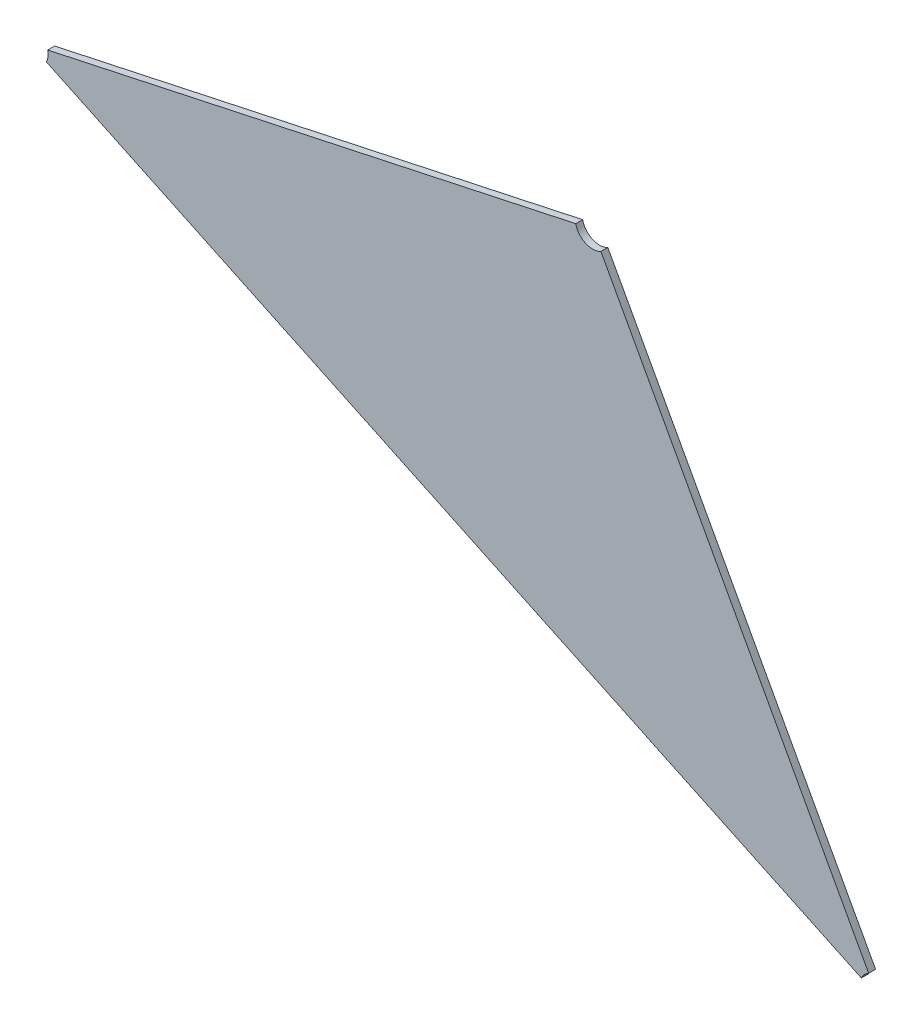
ISO-10303-21;
HEADER;
FILE_DESCRIPTION(('STEP AP214'),'2;1');
FILE_NAME('part.step','',(''),(''),'','','');
FILE_SCHEMA(('AUTOMOTIVE_DESIGN { 1 0 10303 214 1 1 1 1 }'));
ENDSEC;
DATA;
#1=APPLICATION_CONTEXT('core data for automotive mechanical design processes');
#2=APPLICATION_PROTOCOL_DEFINITION('international standard','automotive_design',2000,#1);
#3=PRODUCT_CONTEXT('',#1,'mechanical');
#4=PRODUCT('Part','Part','',(#3));
#5=PRODUCT_RELATED_PRODUCT_CATEGORY('part','',(#4));
#6=PRODUCT_DEFINITION_FORMATION('','',#4);
#7=PRODUCT_DEFINITION_CONTEXT('part definition',#1,'design');
#8=PRODUCT_DEFINITION('design','',#6,#7);
#9=PRODUCT_DEFINITION_SHAPE('','',#8);
#10=(LENGTH_UNIT() NAMED_UNIT(*) SI_UNIT(.MILLI.,.METRE.));
#11=(NAMED_UNIT(*) PLANE_ANGLE_UNIT() SI_UNIT($,.RADIAN.));
#12=(NAMED_UNIT(*) SI_UNIT($,.STERADIAN.) SOLID_ANGLE_UNIT());
#13=UNCERTAINTY_MEASURE_WITH_UNIT(LENGTH_MEASURE(1.E-05),#10,'distance_accuracy_value','');
#14=(GEOMETRIC_REPRESENTATION_CONTEXT(3) GLOBAL_UNCERTAINTY_ASSIGNED_CONTEXT((#13)) GLOBAL_UNIT_ASSIGNED_CONTEXT((#10,
#11,#12)) REPRESENTATION_CONTEXT('',''));
#15=CARTESIAN_POINT('',(0.,0.,0.));
#16=DIRECTION('',(0.,0.,1.));
#17=DIRECTION('',(1.,0.,0.));
#18=AXIS2_PLACEMENT_3D('',#15,#16,#17);
#19=CARTESIAN_POINT('',(-1.29399771700044,-1.37750986813174,0.002));
#20=DIRECTION('',(0.,0.,1.));
#21=DIRECTION('',(-1.,0.,0.));
#22=AXIS2_PLACEMENT_3D('',#19,#20,#21);
#23=CYLINDRICAL_SURFACE('',#22,0.00500000000000003);
#24=DIRECTION('',(0.,0.,-1.));
#25=VECTOR('',#24,1.);
#26=CARTESIAN_POINT('',(-1.29639065897435,-1.37311967124442,0.002));
#27=LINE('',#26,#25);
#28=CARTESIAN_POINT('',(-1.29639065897435,-1.37311967124442,0.002));
#29=VERTEX_POINT('',#28);
#30=CARTESIAN_POINT('',(-1.29639065897435,-1.37311967124442,0.));
#31=VERTEX_POINT('',#30);
#32=EDGE_CURVE('E11',#29,#31,#27,.T.);
#33=ORIENTED_EDGE('',*,*,#32,.F.);
#34=CARTESIAN_POINT('',(-1.29399771700044,-1.37750986813174,0.002));
#35=DIRECTION('',(0.,0.,-1.));
#36=DIRECTION('',(-0.903806397976253,0.427941578930105,0.));
#37=AXIS2_PLACEMENT_3D('',#34,#35,#36);
#38=CIRCLE('',#37,0.00500000000000003);
#39=CARTESIAN_POINT('',(-1.29851674899032,-1.37537016023709,0.002));
#40=VERTEX_POINT('',#39);
#41=EDGE_CURVE('E92',#40,#29,#38,.T.);
#42=ORIENTED_EDGE('',*,*,#41,.F.);
#43=DIRECTION('',(0.,0.,1.));
#44=VECTOR('',#43,1.);
#45=CARTESIAN_POINT('',(-1.29851674899032,-1.37537016023709,0.));
#46=LINE('',#45,#44);
#47=CARTESIAN_POINT('',(-1.29851674899032,-1.37537016023709,0.));
#48=VERTEX_POINT('',#47);
#49=EDGE_CURVE('E97',#48,#40,#46,.T.);
#50=ORIENTED_EDGE('',*,*,#49,.F.);
#51=CARTESIAN_POINT('',(-1.29399771700044,-1.37750986813174,0.));
#52=DIRECTION('',(0.,0.,1.));
#53=DIRECTION('',(-0.47858839478262,0.878039377465154,0.));
#54=AXIS2_PLACEMENT_3D('',#51,#52,#53);
#55=CIRCLE('',#54,0.00500000000000003);
#56=EDGE_CURVE('E113',#31,#48,#55,.T.);
#57=ORIENTED_EDGE('',*,*,#56,.F.);
#58=EDGE_LOOP('',(#33,#42,#50,#57));
#59=FACE_BOUND('',#58,.T.);
#60=ADVANCED_FACE('F17',(#59),#23,.F.);
#61=CARTESIAN_POINT('',(-1.37630287528467,-1.2265091946304,0.002));
#62=DIRECTION('',(0.,0.,1.));
#63=DIRECTION('',(-1.,0.,0.));
#64=AXIS2_PLACEMENT_3D('',#61,#62,#63);
#65=CYLINDRICAL_SURFACE('',#64,0.005);
#66=DIRECTION('',(0.,0.,1.));
#67=VECTOR('',#66,1.);
#68=CARTESIAN_POINT('',(-1.37390993331075,-1.23089939151773,0.));
#69=LINE('',#68,#67);
#70=CARTESIAN_POINT('',(-1.37390993331075,-1.23089939151773,0.));
#71=VERTEX_POINT('',#70);
#72=CARTESIAN_POINT('',(-1.37390993331075,-1.23089939151773,0.002));
#73=VERTEX_POINT('',#72);
#74=EDGE_CURVE('E24',#71,#73,#69,.T.);
#75=ORIENTED_EDGE('',*,*,#74,.F.);
#76=CARTESIAN_POINT('',(-1.37630287528467,-1.2265091946304,0.));
#77=DIRECTION('',(0.,0.,1.));
#78=DIRECTION('',(-0.9776199399691,-0.210378832050218,0.));
#79=AXIS2_PLACEMENT_3D('',#76,#77,#78);
#80=CIRCLE('',#79,0.005);
#81=CARTESIAN_POINT('',(-1.38119097498451,-1.22756108879065,0.));
#82=VERTEX_POINT('',#81);
#83=EDGE_CURVE('E93',#82,#71,#80,.T.);
#84=ORIENTED_EDGE('',*,*,#83,.F.);
#85=DIRECTION('',(-1.11022302462516E-13,0.,-1.));
#86=VECTOR('',#85,1.);
#87=CARTESIAN_POINT('',(-1.38119097498451,-1.22756108879065,0.002));
#88=LINE('',#87,#86);
#89=CARTESIAN_POINT('',(-1.38119097498451,-1.22756108879065,0.002));
#90=VERTEX_POINT('',#89);
#91=EDGE_CURVE('E111',#90,#82,#88,.T.);
#92=ORIENTED_EDGE('',*,*,#91,.F.);
#93=CARTESIAN_POINT('',(-1.37630287528467,-1.2265091946304,0.002));
#94=DIRECTION('',(0.,0.,-1.));
#95=DIRECTION('',(0.478588394783317,-0.878039377464774,0.));
#96=AXIS2_PLACEMENT_3D('',#93,#94,#95);
#97=CIRCLE('',#96,0.005);
#98=EDGE_CURVE('E84',#73,#90,#97,.T.);
#99=ORIENTED_EDGE('',*,*,#98,.F.);
#100=EDGE_LOOP('',(#75,#84,#92,#99));
#101=FACE_BOUND('',#100,.T.);
#102=ADVANCED_FACE('F110',(#101),#65,.F.);
#103=CARTESIAN_POINT('',(-1.53897591651193,-1.26151560460655,0.002));
#104=DIRECTION('',(0.,0.,1.));
#105=DIRECTION('',(0.993380341584743,-0.114871654262396,0.));
#106=AXIS2_PLACEMENT_3D('',#103,#104,#105);
#107=CYLINDRICAL_SURFACE('',#106,0.00500000000000009);
#108=DIRECTION('',(0.,0.,1.));
#109=VECTOR('',#108,1.);
#110=CARTESIAN_POINT('',(-1.53408781681209,-1.2604637104463,0.));
#111=LINE('',#110,#109);
#112=CARTESIAN_POINT('',(-1.53408781681209,-1.2604637104463,0.));
#113=VERTEX_POINT('',#112);
#114=CARTESIAN_POINT('',(-1.53408781681209,-1.2604637104463,0.002));
#115=VERTEX_POINT('',#114);
#116=EDGE_CURVE('E70',#113,#115,#111,.T.);
#117=ORIENTED_EDGE('',*,*,#116,.F.);
#118=CARTESIAN_POINT('',(-1.53897591651193,-1.26151560460655,0.));
#119=DIRECTION('',(0.,0.,1.));
#120=DIRECTION('',(0.903806397976253,-0.427941578930105,0.));
#121=AXIS2_PLACEMENT_3D('',#118,#119,#120);
#122=CIRCLE('',#121,0.00500000000000008);
#123=CARTESIAN_POINT('',(-1.53445688452205,-1.2636553125012,0.));
#124=VERTEX_POINT('',#123);
#125=EDGE_CURVE('E112',#124,#113,#122,.T.);
#126=ORIENTED_EDGE('',*,*,#125,.F.);
#127=DIRECTION('',(0.,0.,-1.));
#128=VECTOR('',#127,1.);
#129=CARTESIAN_POINT('',(-1.53445688452205,-1.2636553125012,0.002));
#130=LINE('',#129,#128);
#131=CARTESIAN_POINT('',(-1.53445688452205,-1.2636553125012,0.002));
#132=VERTEX_POINT('',#131);
#133=EDGE_CURVE('E73',#132,#124,#130,.T.);
#134=ORIENTED_EDGE('',*,*,#133,.F.);
#135=CARTESIAN_POINT('',(-1.53897591651193,-1.26151560460655,0.002));
#136=DIRECTION('',(0.,0.,-1.));
#137=DIRECTION('',(0.977619939969111,0.210378832050166,0.));
#138=AXIS2_PLACEMENT_3D('',#135,#136,#137);
#139=CIRCLE('',#138,0.00500000000000008);
#140=EDGE_CURVE('E66',#115,#132,#139,.T.);
#141=ORIENTED_EDGE('',*,*,#140,.F.);
#142=EDGE_LOOP('',(#117,#126,#134,#141));
#143=FACE_BOUND('',#142,.T.);
#144=ADVANCED_FACE('F68',(#143),#107,.F.);
#145=CARTESIAN_POINT('',(-1.40477055010241,-1.29395884484365,0.002));
#146=DIRECTION('',(0.,0.,1.));
#147=DIRECTION('',(1.,0.,0.));
#148=AXIS2_PLACEMENT_3D('',#145,#146,#147);
#149=PLANE('',#148);
#150=ORIENTED_EDGE('',*,*,#41,.T.);
#151=DIRECTION('',(-0.478588394782364,0.878039377465293,0.));
#152=VECTOR('',#151,1.);
#153=CARTESIAN_POINT('',(-1.29639065897435,-1.37311967124442,0.002));
#154=LINE('',#153,#152);
#155=EDGE_CURVE('E103',#29,#73,#154,.T.);
#156=ORIENTED_EDGE('',*,*,#155,.T.);
#157=ORIENTED_EDGE('',*,*,#98,.T.);
#158=DIRECTION('',(-0.977619939969144,-0.210378832050013,0.));
#159=VECTOR('',#158,1.);
#160=CARTESIAN_POINT('',(-1.38119097498451,-1.22756108879065,0.002));
#161=LINE('',#160,#159);
#162=EDGE_CURVE('E82',#90,#115,#161,.T.);
#163=ORIENTED_EDGE('',*,*,#162,.T.);
#164=ORIENTED_EDGE('',*,*,#140,.T.);
#165=DIRECTION('',(0.903806397975917,-0.427941578930814,0.));
#166=VECTOR('',#165,1.);
#167=CARTESIAN_POINT('',(-1.53445688452205,-1.2636553125012,0.002));
#168=LINE('',#167,#166);
#169=EDGE_CURVE('E77',#132,#40,#168,.T.);
#170=ORIENTED_EDGE('',*,*,#169,.T.);
#171=EDGE_LOOP('',(#150,#156,#157,#163,#164,#170));
#172=FACE_BOUND('',#171,.T.);
#173=ADVANCED_FACE('F83',(#172),#149,.T.);
#174=CARTESIAN_POINT('',(-1.53897591651193,-1.26151560460655,0.));
#175=DIRECTION('',(-0.427941578930813,-0.903806397975918,0.));
#176=DIRECTION('',(0.903806397975918,-0.427941578930813,0.));
#177=AXIS2_PLACEMENT_3D('',#174,#175,#176);
#178=PLANE('',#177);
#179=ORIENTED_EDGE('',*,*,#49,.T.);
#180=ORIENTED_EDGE('',*,*,#169,.F.);
#181=ORIENTED_EDGE('',*,*,#133,.T.);
#182=DIRECTION('',(0.903806397975917,-0.427941578930814,0.));
#183=VECTOR('',#182,1.);
#184=CARTESIAN_POINT('',(-1.53445688452205,-1.2636553125012,0.));
#185=LINE('',#184,#183);
#186=EDGE_CURVE('E107',#124,#48,#185,.T.);
#187=ORIENTED_EDGE('',*,*,#186,.T.);
#188=EDGE_LOOP('',(#179,#180,#181,#187));
#189=FACE_BOUND('',#188,.T.);
#190=ADVANCED_FACE('F121',(#189),#178,.T.);
#191=CARTESIAN_POINT('',(-1.37630287528467,-1.2265091946304,0.));
#192=DIRECTION('',(-0.210378832050013,0.977619939969144,0.));
#193=DIRECTION('',(-0.977619939969144,-0.210378832050013,0.));
#194=AXIS2_PLACEMENT_3D('',#191,#192,#193);
#195=PLANE('',#194);
#196=ORIENTED_EDGE('',*,*,#91,.T.);
#197=DIRECTION('',(-0.977619939969144,-0.210378832050013,0.));
#198=VECTOR('',#197,1.);
#199=CARTESIAN_POINT('',(-1.38119097498451,-1.22756108879065,0.));
#200=LINE('',#199,#198);
#201=EDGE_CURVE('E78',#82,#113,#200,.T.);
#202=ORIENTED_EDGE('',*,*,#201,.T.);
#203=ORIENTED_EDGE('',*,*,#116,.T.);
#204=ORIENTED_EDGE('',*,*,#162,.F.);
#205=EDGE_LOOP('',(#196,#202,#203,#204));
#206=FACE_BOUND('',#205,.T.);
#207=ADVANCED_FACE('F89',(#206),#195,.T.);
#208=CARTESIAN_POINT('',(-1.29399771700044,-1.37750986813174,0.));
#209=DIRECTION('',(0.878039377465294,0.478588394782364,0.));
#210=DIRECTION('',(-0.478588394782364,0.878039377465294,0.));
#211=AXIS2_PLACEMENT_3D('',#208,#209,#210);
#212=PLANE('',#211);
#213=ORIENTED_EDGE('',*,*,#32,.T.);
#214=DIRECTION('',(-0.478588394782364,0.878039377465293,0.));
#215=VECTOR('',#214,1.);
#216=CARTESIAN_POINT('',(-1.29639065897435,-1.37311967124442,0.));
#217=LINE('',#216,#215);
#218=EDGE_CURVE('E87',#31,#71,#217,.T.);
#219=ORIENTED_EDGE('',*,*,#218,.T.);
#220=ORIENTED_EDGE('',*,*,#74,.T.);
#221=ORIENTED_EDGE('',*,*,#155,.F.);
#222=EDGE_LOOP('',(#213,#219,#220,#221));
#223=FACE_BOUND('',#222,.T.);
#224=ADVANCED_FACE('F102',(#223),#212,.T.);
#225=CARTESIAN_POINT('',(-1.40477055010241,-1.29395884484365,0.));
#226=DIRECTION('',(0.,0.,1.));
#227=DIRECTION('',(1.,0.,0.));
#228=AXIS2_PLACEMENT_3D('',#225,#226,#227);
#229=PLANE('',#228);
#230=ORIENTED_EDGE('',*,*,#56,.T.);
#231=ORIENTED_EDGE('',*,*,#186,.F.);
#232=ORIENTED_EDGE('',*,*,#125,.T.);
#233=ORIENTED_EDGE('',*,*,#201,.F.);
#234=ORIENTED_EDGE('',*,*,#83,.T.);
#235=ORIENTED_EDGE('',*,*,#218,.F.);
#236=EDGE_LOOP('',(#230,#231,#232,#233,#234,#235));
#237=FACE_BOUND('',#236,.T.);
#238=ADVANCED_FACE('F109',(#237),#229,.F.);
#239=CLOSED_SHELL('',(#60,#102,#144,#173,#190,#207,#224,#238));
#240=MANIFOLD_SOLID_BREP('B1',#239);
#241=ADVANCED_BREP_SHAPE_REPRESENTATION('',(#18,#240),#14);
#242=SHAPE_DEFINITION_REPRESENTATION(#9,#241);
ENDSEC;
END-ISO-10303-21;
